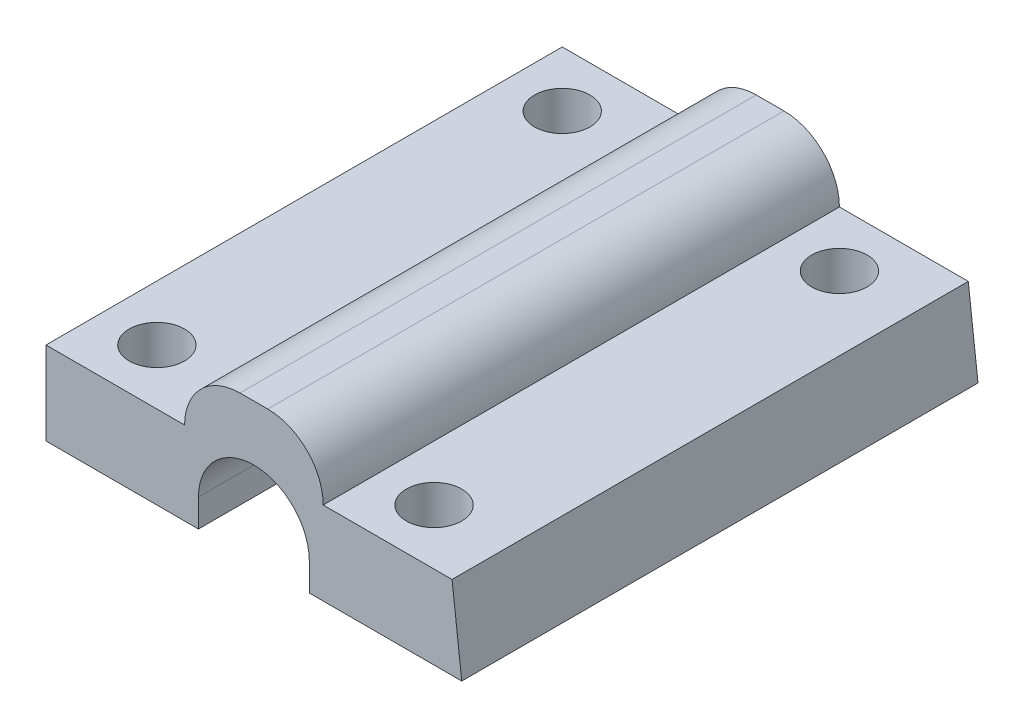
ISO-10303-21;
HEADER;
FILE_DESCRIPTION(('STEP AP214'),'2;1');
FILE_NAME('part.step','',(''),(''),'','','');
FILE_SCHEMA(('AUTOMOTIVE_DESIGN { 1 0 10303 214 1 1 1 1 }'));
ENDSEC;
DATA;
#1=APPLICATION_CONTEXT('core data for automotive mechanical design processes');
#2=APPLICATION_PROTOCOL_DEFINITION('international standard','automotive_design',2000,#1);
#3=PRODUCT_CONTEXT('',#1,'mechanical');
#4=PRODUCT('Part','Part','',(#3));
#5=PRODUCT_RELATED_PRODUCT_CATEGORY('part','',(#4));
#6=PRODUCT_DEFINITION_FORMATION('','',#4);
#7=PRODUCT_DEFINITION_CONTEXT('part definition',#1,'design');
#8=PRODUCT_DEFINITION('design','',#6,#7);
#9=PRODUCT_DEFINITION_SHAPE('','',#8);
#10=(LENGTH_UNIT() NAMED_UNIT(*) SI_UNIT(.MILLI.,.METRE.));
#11=(NAMED_UNIT(*) PLANE_ANGLE_UNIT() SI_UNIT($,.RADIAN.));
#12=(NAMED_UNIT(*) SI_UNIT($,.STERADIAN.) SOLID_ANGLE_UNIT());
#13=UNCERTAINTY_MEASURE_WITH_UNIT(LENGTH_MEASURE(1.E-05),#10,'distance_accuracy_value','');
#14=(GEOMETRIC_REPRESENTATION_CONTEXT(3) GLOBAL_UNCERTAINTY_ASSIGNED_CONTEXT((#13)) GLOBAL_UNIT_ASSIGNED_CONTEXT((#10,
#11,#12)) REPRESENTATION_CONTEXT('',''));
#15=CARTESIAN_POINT('',(0.,0.,0.));
#16=DIRECTION('',(0.,0.,1.));
#17=DIRECTION('',(1.,0.,0.));
#18=AXIS2_PLACEMENT_3D('',#15,#16,#17);
#19=CARTESIAN_POINT('',(0.,0.,0.));
#20=DIRECTION('',(0.,1.,0.));
#21=DIRECTION('',(0.,0.,1.));
#22=AXIS2_PLACEMENT_3D('',#19,#20,#21);
#23=PLANE('',#22);
#24=CARTESIAN_POINT('',(-8.21354166666667,0.,24.8645833333333));
#25=DIRECTION('',(0.,1.,0.));
#26=DIRECTION('',(0.,0.,1.));
#27=AXIS2_PLACEMENT_3D('',#24,#25,#26);
#28=CIRCLE('',#27,2.);
#29=CARTESIAN_POINT('',(-8.21354166666667,0.,26.8645833333333));
#30=VERTEX_POINT('',#29);
#31=EDGE_CURVE('E239',#30,#30,#28,.T.);
#32=ORIENTED_EDGE('',*,*,#31,.T.);
#33=EDGE_LOOP('',(#32));
#34=FACE_BOUND('',#33,.T.);
#35=CARTESIAN_POINT('',(-8.21354166666668,0.,-4.38541666666667));
#36=DIRECTION('',(0.,1.,0.));
#37=DIRECTION('',(0.,0.,1.));
#38=AXIS2_PLACEMENT_3D('',#35,#36,#37);
#39=CIRCLE('',#38,2.);
#40=CARTESIAN_POINT('',(-8.21354166666668,0.,-2.38541666666667));
#41=VERTEX_POINT('',#40);
#42=EDGE_CURVE('E233',#41,#41,#39,.T.);
#43=ORIENTED_EDGE('',*,*,#42,.T.);
#44=EDGE_LOOP('',(#43));
#45=FACE_BOUND('',#44,.T.);
#46=DIRECTION('',(-1.,0.,0.));
#47=VECTOR('',#46,1.);
#48=CARTESIAN_POINT('',(-12.2135416666667,0.,-8.38541666666667));
#49=LINE('',#48,#47);
#50=CARTESIAN_POINT('',(-1.21354166666667,0.,-8.38541666666667));
#51=VERTEX_POINT('',#50);
#52=CARTESIAN_POINT('',(-12.2135416666667,0.,-8.38541666666667));
#53=VERTEX_POINT('',#52);
#54=EDGE_CURVE('E141',#51,#53,#49,.T.);
#55=ORIENTED_EDGE('',*,*,#54,.F.);
#56=DIRECTION('',(0.,0.,-1.));
#57=VECTOR('',#56,1.);
#58=CARTESIAN_POINT('',(-1.21354166666668,0.,28.8645833333333));
#59=LINE('',#58,#57);
#60=CARTESIAN_POINT('',(-1.21354166666668,0.,28.8645833333333));
#61=VERTEX_POINT('',#60);
#62=EDGE_CURVE('E186',#61,#51,#59,.T.);
#63=ORIENTED_EDGE('',*,*,#62,.F.);
#64=DIRECTION('',(1.,0.,0.));
#65=VECTOR('',#64,1.);
#66=CARTESIAN_POINT('',(-12.2135416666667,0.,28.8645833333333));
#67=LINE('',#66,#65);
#68=CARTESIAN_POINT('',(-12.2135416666667,0.,28.8645833333333));
#69=VERTEX_POINT('',#68);
#70=EDGE_CURVE('E142',#69,#61,#67,.T.);
#71=ORIENTED_EDGE('',*,*,#70,.F.);
#72=DIRECTION('',(0.,0.,1.));
#73=VECTOR('',#72,1.);
#74=CARTESIAN_POINT('',(-12.2135416666667,0.,-8.38541666666667));
#75=LINE('',#74,#73);
#76=EDGE_CURVE('E242',#53,#69,#75,.T.);
#77=ORIENTED_EDGE('',*,*,#76,.F.);
#78=EDGE_LOOP('',(#55,#63,#71,#77));
#79=FACE_BOUND('',#78,.T.);
#80=ADVANCED_FACE('F33',(#34,#45,#79),#23,.F.);
#81=CARTESIAN_POINT('',(0.,6.,0.));
#82=DIRECTION('',(0.,1.,0.));
#83=DIRECTION('',(0.,0.,1.));
#84=AXIS2_PLACEMENT_3D('',#81,#82,#83);
#85=PLANE('',#84);
#86=DIRECTION('',(0.,0.,1.));
#87=VECTOR('',#86,1.);
#88=CARTESIAN_POINT('',(-2.21354166666668,6.,-8.38541666666667));
#89=LINE('',#88,#87);
#90=CARTESIAN_POINT('',(-2.21354166666667,6.,-8.38541666666667));
#91=VERTEX_POINT('',#90);
#92=CARTESIAN_POINT('',(-2.21354166666667,6.,28.8645833333333));
#93=VERTEX_POINT('',#92);
#94=EDGE_CURVE('E205',#91,#93,#89,.T.);
#95=ORIENTED_EDGE('',*,*,#94,.F.);
#96=DIRECTION('',(-1.,0.,0.));
#97=VECTOR('',#96,1.);
#98=CARTESIAN_POINT('',(-12.2135416666667,6.,-8.38541666666667));
#99=LINE('',#98,#97);
#100=CARTESIAN_POINT('',(-12.2135416666667,6.,-8.38541666666667));
#101=VERTEX_POINT('',#100);
#102=EDGE_CURVE('E208',#91,#101,#99,.T.);
#103=ORIENTED_EDGE('',*,*,#102,.T.);
#104=DIRECTION('',(0.,0.,1.));
#105=VECTOR('',#104,1.);
#106=CARTESIAN_POINT('',(-12.2135416666667,6.,-8.38541666666667));
#107=LINE('',#106,#105);
#108=CARTESIAN_POINT('',(-12.2135416666667,6.,28.8645833333333));
#109=VERTEX_POINT('',#108);
#110=EDGE_CURVE('E156',#101,#109,#107,.T.);
#111=ORIENTED_EDGE('',*,*,#110,.T.);
#112=DIRECTION('',(1.,0.,0.));
#113=VECTOR('',#112,1.);
#114=CARTESIAN_POINT('',(-12.2135416666667,6.,28.8645833333333));
#115=LINE('',#114,#113);
#116=EDGE_CURVE('E196',#109,#93,#115,.T.);
#117=ORIENTED_EDGE('',*,*,#116,.T.);
#118=EDGE_LOOP('',(#95,#103,#111,#117));
#119=FACE_BOUND('',#118,.T.);
#120=CARTESIAN_POINT('',(-8.21354166666667,6.,24.8645833333333));
#121=DIRECTION('',(0.,1.,0.));
#122=DIRECTION('',(0.,0.,1.));
#123=AXIS2_PLACEMENT_3D('',#120,#121,#122);
#124=CIRCLE('',#123,2.);
#125=CARTESIAN_POINT('',(-8.21354166666667,6.,26.8645833333333));
#126=VERTEX_POINT('',#125);
#127=EDGE_CURVE('E223',#126,#126,#124,.T.);
#128=ORIENTED_EDGE('',*,*,#127,.F.);
#129=EDGE_LOOP('',(#128));
#130=FACE_BOUND('',#129,.T.);
#131=CARTESIAN_POINT('',(-8.21354166666668,6.,-4.38541666666667));
#132=DIRECTION('',(0.,1.,0.));
#133=DIRECTION('',(0.,0.,1.));
#134=AXIS2_PLACEMENT_3D('',#131,#132,#133);
#135=CIRCLE('',#134,2.);
#136=CARTESIAN_POINT('',(-8.21354166666668,6.,-2.38541666666667));
#137=VERTEX_POINT('',#136);
#138=EDGE_CURVE('E236',#137,#137,#135,.T.);
#139=ORIENTED_EDGE('',*,*,#138,.F.);
#140=EDGE_LOOP('',(#139));
#141=FACE_BOUND('',#140,.T.);
#142=ADVANCED_FACE('F203',(#119,#130,#141),#85,.T.);
#143=CARTESIAN_POINT('',(-12.2135416666667,6.,-8.38541666666667));
#144=DIRECTION('',(1.,0.,0.));
#145=DIRECTION('',(0.,0.,-1.));
#146=AXIS2_PLACEMENT_3D('',#143,#144,#145);
#147=PLANE('',#146);
#148=ORIENTED_EDGE('',*,*,#76,.T.);
#149=DIRECTION('',(0.,-1.,0.));
#150=VECTOR('',#149,1.);
#151=CARTESIAN_POINT('',(-12.2135416666667,6.,28.8645833333333));
#152=LINE('',#151,#150);
#153=EDGE_CURVE('E166',#109,#69,#152,.T.);
#154=ORIENTED_EDGE('',*,*,#153,.F.);
#155=ORIENTED_EDGE('',*,*,#110,.F.);
#156=DIRECTION('',(0.,-1.,0.));
#157=VECTOR('',#156,1.);
#158=CARTESIAN_POINT('',(-12.2135416666667,6.,-8.38541666666667));
#159=LINE('',#158,#157);
#160=EDGE_CURVE('E163',#101,#53,#159,.T.);
#161=ORIENTED_EDGE('',*,*,#160,.T.);
#162=EDGE_LOOP('',(#148,#154,#155,#161));
#163=FACE_BOUND('',#162,.T.);
#164=ADVANCED_FACE('F303',(#163),#147,.F.);
#165=CARTESIAN_POINT('',(-12.2135416666667,6.,28.8645833333333));
#166=DIRECTION('',(0.,0.,-1.));
#167=DIRECTION('',(-1.,0.,0.));
#168=AXIS2_PLACEMENT_3D('',#165,#166,#167);
#169=PLANE('',#168);
#170=CARTESIAN_POINT('',(6.78645833333333,0.,28.8645833333333));
#171=VERTEX_POINT('',#170);
#172=CARTESIAN_POINT('',(17.7864583333333,0.,28.8645833333333));
#173=VERTEX_POINT('',#172);
#174=EDGE_CURVE('E247',#171,#173,#67,.T.);
#175=ORIENTED_EDGE('',*,*,#174,.T.);
#176=DIRECTION('',(-0.115969466330902,0.99325277894347,0.));
#177=VECTOR('',#176,1.);
#178=CARTESIAN_POINT('',(16.6918688514665,9.37491633844634,28.8645833333333));
#179=LINE('',#178,#177);
#180=CARTESIAN_POINT('',(17.0859148133589,6.,28.8645833333333));
#181=VERTEX_POINT('',#180);
#182=EDGE_CURVE('E136',#173,#181,#179,.T.);
#183=ORIENTED_EDGE('',*,*,#182,.T.);
#184=CARTESIAN_POINT('',(7.78645833333333,6.,28.8645833333333));
#185=VERTEX_POINT('',#184);
#186=EDGE_CURVE('E159',#185,#181,#115,.T.);
#187=ORIENTED_EDGE('',*,*,#186,.F.);
#188=CARTESIAN_POINT('',(3.78645833333333,6.,28.8645833333333));
#189=DIRECTION('',(0.,0.,-1.));
#190=DIRECTION('',(-1.,0.,0.));
#191=AXIS2_PLACEMENT_3D('',#188,#189,#190);
#192=CIRCLE('',#191,4.);
#193=CARTESIAN_POINT('',(3.78645833333333,10.,28.8645833333333));
#194=VERTEX_POINT('',#193);
#195=EDGE_CURVE('E11',#185,#194,#192,.F.);
#196=ORIENTED_EDGE('',*,*,#195,.T.);
#197=DIRECTION('',(1.,0.,0.));
#198=VECTOR('',#197,1.);
#199=CARTESIAN_POINT('',(-2.21354166666667,10.,28.8645833333333));
#200=LINE('',#199,#198);
#201=CARTESIAN_POINT('',(1.78645833333333,10.,28.8645833333333));
#202=VERTEX_POINT('',#201);
#203=EDGE_CURVE('E198',#202,#194,#200,.T.);
#204=ORIENTED_EDGE('',*,*,#203,.F.);
#205=CARTESIAN_POINT('',(1.78645833333333,6.,28.8645833333333));
#206=DIRECTION('',(0.,0.,-1.));
#207=DIRECTION('',(-1.,0.,0.));
#208=AXIS2_PLACEMENT_3D('',#205,#206,#207);
#209=CIRCLE('',#208,4.);
#210=EDGE_CURVE('E41',#202,#93,#209,.F.);
#211=ORIENTED_EDGE('',*,*,#210,.T.);
#212=ORIENTED_EDGE('',*,*,#116,.F.);
#213=ORIENTED_EDGE('',*,*,#153,.T.);
#214=ORIENTED_EDGE('',*,*,#70,.T.);
#215=DIRECTION('',(0.,-1.,0.));
#216=VECTOR('',#215,1.);
#217=CARTESIAN_POINT('',(-1.21354166666668,6.,28.8645833333333));
#218=LINE('',#217,#216);
#219=CARTESIAN_POINT('',(-1.21354166666668,2.,28.8645833333333));
#220=VERTEX_POINT('',#219);
#221=EDGE_CURVE('E211',#220,#61,#218,.T.);
#222=ORIENTED_EDGE('',*,*,#221,.F.);
#223=CARTESIAN_POINT('',(2.78645833333332,2.,28.8645833333333));
#224=DIRECTION('',(0.,0.,-1.));
#225=DIRECTION('',(-1.,0.,0.));
#226=AXIS2_PLACEMENT_3D('',#223,#224,#225);
#227=CIRCLE('',#226,4.);
#228=CARTESIAN_POINT('',(2.78645833333333,6.,28.8645833333333));
#229=VERTEX_POINT('',#228);
#230=EDGE_CURVE('E180',#220,#229,#227,.T.);
#231=ORIENTED_EDGE('',*,*,#230,.T.);
#232=CARTESIAN_POINT('',(2.78645833333333,2.,28.8645833333333));
#233=DIRECTION('',(0.,0.,-1.));
#234=DIRECTION('',(-1.,0.,0.));
#235=AXIS2_PLACEMENT_3D('',#232,#233,#234);
#236=CIRCLE('',#235,4.);
#237=CARTESIAN_POINT('',(6.78645833333333,2.,28.8645833333333));
#238=VERTEX_POINT('',#237);
#239=EDGE_CURVE('E174',#229,#238,#236,.T.);
#240=ORIENTED_EDGE('',*,*,#239,.T.);
#241=DIRECTION('',(0.,-1.,0.));
#242=VECTOR('',#241,1.);
#243=CARTESIAN_POINT('',(6.78645833333333,6.,28.8645833333333));
#244=LINE('',#243,#242);
#245=EDGE_CURVE('E214',#238,#171,#244,.T.);
#246=ORIENTED_EDGE('',*,*,#245,.T.);
#247=EDGE_LOOP('',(#175,#183,#187,#196,#204,#211,#212,#213,#214,#222,#231,#240,#246));
#248=FACE_BOUND('',#247,.T.);
#249=ADVANCED_FACE('F195',(#248),#169,.F.);
#250=CARTESIAN_POINT('',(-12.2135416666667,6.,-8.38541666666667));
#251=DIRECTION('',(0.,0.,1.));
#252=DIRECTION('',(1.,0.,0.));
#253=AXIS2_PLACEMENT_3D('',#250,#251,#252);
#254=PLANE('',#253);
#255=CARTESIAN_POINT('',(17.0859148133589,6.,-8.38541666666667));
#256=VERTEX_POINT('',#255);
#257=CARTESIAN_POINT('',(7.78645833333333,6.,-8.38541666666667));
#258=VERTEX_POINT('',#257);
#259=EDGE_CURVE('E149',#256,#258,#99,.T.);
#260=ORIENTED_EDGE('',*,*,#259,.F.);
#261=DIRECTION('',(-0.115969466330902,0.99325277894347,0.));
#262=VECTOR('',#261,1.);
#263=CARTESIAN_POINT('',(17.7864583333333,0.,-8.38541666666667));
#264=LINE('',#263,#262);
#265=CARTESIAN_POINT('',(17.7864583333333,0.,-8.38541666666667));
#266=VERTEX_POINT('',#265);
#267=EDGE_CURVE('E133',#266,#256,#264,.T.);
#268=ORIENTED_EDGE('',*,*,#267,.F.);
#269=CARTESIAN_POINT('',(6.78645833333333,0.,-8.38541666666667));
#270=VERTEX_POINT('',#269);
#271=EDGE_CURVE('E148',#266,#270,#49,.T.);
#272=ORIENTED_EDGE('',*,*,#271,.T.);
#273=DIRECTION('',(0.,-1.,0.));
#274=VECTOR('',#273,1.);
#275=CARTESIAN_POINT('',(6.78645833333334,6.,-8.38541666666667));
#276=LINE('',#275,#274);
#277=CARTESIAN_POINT('',(6.78645833333334,2.,-8.38541666666667));
#278=VERTEX_POINT('',#277);
#279=EDGE_CURVE('E256',#278,#270,#276,.T.);
#280=ORIENTED_EDGE('',*,*,#279,.F.);
#281=CARTESIAN_POINT('',(2.78645833333334,2.,-8.38541666666667));
#282=DIRECTION('',(0.,0.,1.));
#283=DIRECTION('',(1.,0.,0.));
#284=AXIS2_PLACEMENT_3D('',#281,#282,#283);
#285=CIRCLE('',#284,4.);
#286=CARTESIAN_POINT('',(2.78645833333334,6.,-8.38541666666667));
#287=VERTEX_POINT('',#286);
#288=EDGE_CURVE('E176',#278,#287,#285,.T.);
#289=ORIENTED_EDGE('',*,*,#288,.T.);
#290=CARTESIAN_POINT('',(2.78645833333333,2.,-8.38541666666667));
#291=DIRECTION('',(0.,0.,1.));
#292=DIRECTION('',(1.,0.,0.));
#293=AXIS2_PLACEMENT_3D('',#290,#291,#292);
#294=CIRCLE('',#293,4.);
#295=CARTESIAN_POINT('',(-1.21354166666667,2.,-8.38541666666667));
#296=VERTEX_POINT('',#295);
#297=EDGE_CURVE('E178',#287,#296,#294,.T.);
#298=ORIENTED_EDGE('',*,*,#297,.T.);
#299=DIRECTION('',(0.,-1.,0.));
#300=VECTOR('',#299,1.);
#301=CARTESIAN_POINT('',(-1.21354166666667,6.,-8.38541666666667));
#302=LINE('',#301,#300);
#303=EDGE_CURVE('E259',#296,#51,#302,.T.);
#304=ORIENTED_EDGE('',*,*,#303,.T.);
#305=ORIENTED_EDGE('',*,*,#54,.T.);
#306=ORIENTED_EDGE('',*,*,#160,.F.);
#307=ORIENTED_EDGE('',*,*,#102,.F.);
#308=CARTESIAN_POINT('',(1.78645833333332,6.,-8.38541666666667));
#309=DIRECTION('',(0.,0.,1.));
#310=DIRECTION('',(1.,0.,0.));
#311=AXIS2_PLACEMENT_3D('',#308,#309,#310);
#312=CIRCLE('',#311,4.);
#313=CARTESIAN_POINT('',(1.78645833333332,10.,-8.38541666666667));
#314=VERTEX_POINT('',#313);
#315=EDGE_CURVE('E48',#91,#314,#312,.F.);
#316=ORIENTED_EDGE('',*,*,#315,.T.);
#317=DIRECTION('',(-1.,0.,0.));
#318=VECTOR('',#317,1.);
#319=CARTESIAN_POINT('',(-2.21354166666668,10.,-8.38541666666667));
#320=LINE('',#319,#318);
#321=CARTESIAN_POINT('',(3.78645833333333,10.,-8.38541666666667));
#322=VERTEX_POINT('',#321);
#323=EDGE_CURVE('E217',#322,#314,#320,.T.);
#324=ORIENTED_EDGE('',*,*,#323,.F.);
#325=CARTESIAN_POINT('',(3.78645833333333,6.,-8.38541666666667));
#326=DIRECTION('',(0.,0.,1.));
#327=DIRECTION('',(1.,0.,0.));
#328=AXIS2_PLACEMENT_3D('',#325,#326,#327);
#329=CIRCLE('',#328,4.);
#330=EDGE_CURVE('E56',#322,#258,#329,.F.);
#331=ORIENTED_EDGE('',*,*,#330,.T.);
#332=EDGE_LOOP('',(#260,#268,#272,#280,#289,#298,#304,#305,#306,#307,#316,#324,#331));
#333=FACE_BOUND('',#332,.T.);
#334=ADVANCED_FACE('F146',(#333),#254,.F.);
#335=DIRECTION('',(0.,0.,-1.));
#336=VECTOR('',#335,1.);
#337=CARTESIAN_POINT('',(17.0859148133589,6.,41.6145833333333));
#338=LINE('',#337,#336);
#339=EDGE_CURVE('E150',#181,#256,#338,.T.);
#340=ORIENTED_EDGE('',*,*,#339,.T.);
#341=ORIENTED_EDGE('',*,*,#259,.T.);
#342=DIRECTION('',(0.,0.,-1.));
#343=VECTOR('',#342,1.);
#344=CARTESIAN_POINT('',(7.78645833333333,6.,-8.38541666666667));
#345=LINE('',#344,#343);
#346=EDGE_CURVE('E210',#185,#258,#345,.T.);
#347=ORIENTED_EDGE('',*,*,#346,.F.);
#348=ORIENTED_EDGE('',*,*,#186,.T.);
#349=EDGE_LOOP('',(#340,#341,#347,#348));
#350=FACE_BOUND('',#349,.T.);
#351=CARTESIAN_POINT('',(11.7864583333333,6.,24.8645833333333));
#352=DIRECTION('',(0.,1.,0.));
#353=DIRECTION('',(0.,0.,1.));
#354=AXIS2_PLACEMENT_3D('',#351,#352,#353);
#355=CIRCLE('',#354,2.);
#356=CARTESIAN_POINT('',(11.7864583333333,6.,26.8645833333333));
#357=VERTEX_POINT('',#356);
#358=EDGE_CURVE('E230',#357,#357,#355,.T.);
#359=ORIENTED_EDGE('',*,*,#358,.F.);
#360=EDGE_LOOP('',(#359));
#361=FACE_BOUND('',#360,.T.);
#362=CARTESIAN_POINT('',(11.7864583333333,6.,-4.38541666666667));
#363=DIRECTION('',(0.,1.,0.));
#364=DIRECTION('',(0.,0.,1.));
#365=AXIS2_PLACEMENT_3D('',#362,#363,#364);
#366=CIRCLE('',#365,2.);
#367=CARTESIAN_POINT('',(11.7864583333333,6.,-2.38541666666667));
#368=VERTEX_POINT('',#367);
#369=EDGE_CURVE('E224',#368,#368,#366,.T.);
#370=ORIENTED_EDGE('',*,*,#369,.F.);
#371=EDGE_LOOP('',(#370));
#372=FACE_BOUND('',#371,.T.);
#373=ADVANCED_FACE('F271',(#350,#361,#372),#85,.T.);
#374=CARTESIAN_POINT('',(11.7864583333333,0.,24.8645833333333));
#375=DIRECTION('',(0.,1.,0.));
#376=DIRECTION('',(0.,0.,1.));
#377=AXIS2_PLACEMENT_3D('',#374,#375,#376);
#378=CIRCLE('',#377,2.);
#379=CARTESIAN_POINT('',(11.7864583333333,0.,26.8645833333333));
#380=VERTEX_POINT('',#379);
#381=EDGE_CURVE('E227',#380,#380,#378,.T.);
#382=ORIENTED_EDGE('',*,*,#381,.T.);
#383=EDGE_LOOP('',(#382));
#384=FACE_BOUND('',#383,.T.);
#385=CARTESIAN_POINT('',(11.7864583333333,0.,-4.38541666666667));
#386=DIRECTION('',(0.,1.,0.));
#387=DIRECTION('',(0.,0.,1.));
#388=AXIS2_PLACEMENT_3D('',#385,#386,#387);
#389=CIRCLE('',#388,2.);
#390=CARTESIAN_POINT('',(11.7864583333333,0.,-2.38541666666667));
#391=VERTEX_POINT('',#390);
#392=EDGE_CURVE('E220',#391,#391,#389,.T.);
#393=ORIENTED_EDGE('',*,*,#392,.T.);
#394=EDGE_LOOP('',(#393));
#395=FACE_BOUND('',#394,.T.);
#396=ORIENTED_EDGE('',*,*,#174,.F.);
#397=DIRECTION('',(0.,0.,1.));
#398=VECTOR('',#397,1.);
#399=CARTESIAN_POINT('',(6.78645833333333,0.,28.8645833333333));
#400=LINE('',#399,#398);
#401=EDGE_CURVE('E155',#270,#171,#400,.T.);
#402=ORIENTED_EDGE('',*,*,#401,.F.);
#403=ORIENTED_EDGE('',*,*,#271,.F.);
#404=DIRECTION('',(0.,0.,-1.));
#405=VECTOR('',#404,1.);
#406=CARTESIAN_POINT('',(17.7864583333333,0.,-8.38541666666667));
#407=LINE('',#406,#405);
#408=EDGE_CURVE('E130',#173,#266,#407,.T.);
#409=ORIENTED_EDGE('',*,*,#408,.F.);
#410=EDGE_LOOP('',(#396,#402,#403,#409));
#411=FACE_BOUND('',#410,.T.);
#412=ADVANCED_FACE('F153',(#384,#395,#411),#23,.F.);
#413=CARTESIAN_POINT('',(-8.21354166666667,0.,24.8645833333333));
#414=DIRECTION('',(0.,1.,0.));
#415=DIRECTION('',(0.,0.,1.));
#416=AXIS2_PLACEMENT_3D('',#413,#414,#415);
#417=CYLINDRICAL_SURFACE('',#416,2.);
#418=ORIENTED_EDGE('',*,*,#31,.F.);
#419=EDGE_LOOP('',(#418));
#420=FACE_BOUND('',#419,.T.);
#421=ORIENTED_EDGE('',*,*,#127,.T.);
#422=EDGE_LOOP('',(#421));
#423=FACE_BOUND('',#422,.T.);
#424=ADVANCED_FACE('F283',(#420,#423),#417,.F.);
#425=CARTESIAN_POINT('',(11.7864583333333,0.,-4.38541666666667));
#426=DIRECTION('',(0.,1.,0.));
#427=DIRECTION('',(0.,0.,1.));
#428=AXIS2_PLACEMENT_3D('',#425,#426,#427);
#429=CYLINDRICAL_SURFACE('',#428,2.);
#430=ORIENTED_EDGE('',*,*,#392,.F.);
#431=EDGE_LOOP('',(#430));
#432=FACE_BOUND('',#431,.T.);
#433=ORIENTED_EDGE('',*,*,#369,.T.);
#434=EDGE_LOOP('',(#433));
#435=FACE_BOUND('',#434,.T.);
#436=ADVANCED_FACE('F280',(#432,#435),#429,.F.);
#437=CARTESIAN_POINT('',(11.7864583333333,0.,24.8645833333333));
#438=DIRECTION('',(0.,1.,0.));
#439=DIRECTION('',(0.,0.,1.));
#440=AXIS2_PLACEMENT_3D('',#437,#438,#439);
#441=CYLINDRICAL_SURFACE('',#440,2.);
#442=ORIENTED_EDGE('',*,*,#381,.F.);
#443=EDGE_LOOP('',(#442));
#444=FACE_BOUND('',#443,.T.);
#445=ORIENTED_EDGE('',*,*,#358,.T.);
#446=EDGE_LOOP('',(#445));
#447=FACE_BOUND('',#446,.T.);
#448=ADVANCED_FACE('F282',(#444,#447),#441,.F.);
#449=CARTESIAN_POINT('',(-8.21354166666668,0.,-4.38541666666667));
#450=DIRECTION('',(0.,1.,0.));
#451=DIRECTION('',(0.,0.,1.));
#452=AXIS2_PLACEMENT_3D('',#449,#450,#451);
#453=CYLINDRICAL_SURFACE('',#452,2.);
#454=ORIENTED_EDGE('',*,*,#42,.F.);
#455=EDGE_LOOP('',(#454));
#456=FACE_BOUND('',#455,.T.);
#457=ORIENTED_EDGE('',*,*,#138,.T.);
#458=EDGE_LOOP('',(#457));
#459=FACE_BOUND('',#458,.T.);
#460=ADVANCED_FACE('F290',(#456,#459),#453,.F.);
#461=CARTESIAN_POINT('',(0.,10.,0.));
#462=DIRECTION('',(0.,1.,0.));
#463=DIRECTION('',(0.,0.,1.));
#464=AXIS2_PLACEMENT_3D('',#461,#462,#463);
#465=PLANE('',#464);
#466=ORIENTED_EDGE('',*,*,#203,.T.);
#467=DIRECTION('',(0.,0.,-1.));
#468=VECTOR('',#467,1.);
#469=CARTESIAN_POINT('',(3.78645833333333,10.,-8.38541666666667));
#470=LINE('',#469,#468);
#471=EDGE_CURVE('E189',#194,#322,#470,.T.);
#472=ORIENTED_EDGE('',*,*,#471,.T.);
#473=ORIENTED_EDGE('',*,*,#323,.T.);
#474=DIRECTION('',(0.,0.,1.));
#475=VECTOR('',#474,1.);
#476=CARTESIAN_POINT('',(1.78645833333333,10.,28.8645833333333));
#477=LINE('',#476,#475);
#478=EDGE_CURVE('E182',#314,#202,#477,.T.);
#479=ORIENTED_EDGE('',*,*,#478,.T.);
#480=EDGE_LOOP('',(#466,#472,#473,#479));
#481=FACE_BOUND('',#480,.T.);
#482=ADVANCED_FACE('F267',(#481),#465,.T.);
#483=CARTESIAN_POINT('',(-1.21354166666668,6.,28.8645833333333));
#484=DIRECTION('',(-1.,0.,0.));
#485=DIRECTION('',(0.,0.,1.));
#486=AXIS2_PLACEMENT_3D('',#483,#484,#485);
#487=PLANE('',#486);
#488=ORIENTED_EDGE('',*,*,#303,.F.);
#489=DIRECTION('',(0.,0.,-1.));
#490=VECTOR('',#489,1.);
#491=CARTESIAN_POINT('',(-1.21354166666668,2.,28.8645833333333));
#492=LINE('',#491,#490);
#493=EDGE_CURVE('E172',#296,#220,#492,.F.);
#494=ORIENTED_EDGE('',*,*,#493,.T.);
#495=ORIENTED_EDGE('',*,*,#221,.T.);
#496=ORIENTED_EDGE('',*,*,#62,.T.);
#497=EDGE_LOOP('',(#488,#494,#495,#496));
#498=FACE_BOUND('',#497,.T.);
#499=ADVANCED_FACE('F359',(#498),#487,.F.);
#500=CARTESIAN_POINT('',(6.78645833333333,6.,28.8645833333333));
#501=DIRECTION('',(1.,0.,0.));
#502=DIRECTION('',(0.,0.,-1.));
#503=AXIS2_PLACEMENT_3D('',#500,#501,#502);
#504=PLANE('',#503);
#505=ORIENTED_EDGE('',*,*,#245,.F.);
#506=DIRECTION('',(0.,0.,1.));
#507=VECTOR('',#506,1.);
#508=CARTESIAN_POINT('',(6.78645833333333,2.,28.8645833333333));
#509=LINE('',#508,#507);
#510=EDGE_CURVE('E169',#238,#278,#509,.F.);
#511=ORIENTED_EDGE('',*,*,#510,.T.);
#512=ORIENTED_EDGE('',*,*,#279,.T.);
#513=ORIENTED_EDGE('',*,*,#401,.T.);
#514=EDGE_LOOP('',(#505,#511,#512,#513));
#515=FACE_BOUND('',#514,.T.);
#516=ADVANCED_FACE('F258',(#515),#504,.F.);
#517=CARTESIAN_POINT('',(2.78645833333333,2.,0.));
#518=DIRECTION('',(0.,0.,-1.));
#519=DIRECTION('',(-1.,0.,0.));
#520=AXIS2_PLACEMENT_3D('',#517,#518,#519);
#521=CYLINDRICAL_SURFACE('',#520,4.);
#522=ORIENTED_EDGE('',*,*,#493,.F.);
#523=ORIENTED_EDGE('',*,*,#297,.F.);
#524=DIRECTION('',(0.,0.,-1.));
#525=VECTOR('',#524,1.);
#526=CARTESIAN_POINT('',(2.78645833333333,6.,0.));
#527=LINE('',#526,#525);
#528=EDGE_CURVE('E183',#229,#287,#527,.T.);
#529=ORIENTED_EDGE('',*,*,#528,.F.);
#530=ORIENTED_EDGE('',*,*,#230,.F.);
#531=EDGE_LOOP('',(#522,#523,#529,#530));
#532=FACE_BOUND('',#531,.T.);
#533=ADVANCED_FACE('F343',(#532),#521,.F.);
#534=CARTESIAN_POINT('',(2.78645833333333,2.,0.));
#535=DIRECTION('',(0.,0.,1.));
#536=DIRECTION('',(1.,0.,0.));
#537=AXIS2_PLACEMENT_3D('',#534,#535,#536);
#538=CYLINDRICAL_SURFACE('',#537,4.);
#539=ORIENTED_EDGE('',*,*,#288,.F.);
#540=ORIENTED_EDGE('',*,*,#510,.F.);
#541=ORIENTED_EDGE('',*,*,#239,.F.);
#542=ORIENTED_EDGE('',*,*,#528,.T.);
#543=EDGE_LOOP('',(#539,#540,#541,#542));
#544=FACE_BOUND('',#543,.T.);
#545=ADVANCED_FACE('F336',(#544),#538,.F.);
#546=CARTESIAN_POINT('',(3.78645833333333,6.,0.));
#547=DIRECTION('',(0.,0.,1.));
#548=DIRECTION('',(1.,0.,0.));
#549=AXIS2_PLACEMENT_3D('',#546,#547,#548);
#550=CYLINDRICAL_SURFACE('',#549,4.);
#551=ORIENTED_EDGE('',*,*,#195,.F.);
#552=ORIENTED_EDGE('',*,*,#346,.T.);
#553=ORIENTED_EDGE('',*,*,#330,.F.);
#554=ORIENTED_EDGE('',*,*,#471,.F.);
#555=EDGE_LOOP('',(#551,#552,#553,#554));
#556=FACE_BOUND('',#555,.T.);
#557=ADVANCED_FACE('F269',(#556),#550,.T.);
#558=CARTESIAN_POINT('',(1.78645833333333,6.,0.));
#559=DIRECTION('',(0.,0.,-1.));
#560=DIRECTION('',(-1.,0.,0.));
#561=AXIS2_PLACEMENT_3D('',#558,#559,#560);
#562=CYLINDRICAL_SURFACE('',#561,4.);
#563=ORIENTED_EDGE('',*,*,#315,.F.);
#564=ORIENTED_EDGE('',*,*,#94,.T.);
#565=ORIENTED_EDGE('',*,*,#210,.F.);
#566=ORIENTED_EDGE('',*,*,#478,.F.);
#567=EDGE_LOOP('',(#563,#564,#565,#566));
#568=FACE_BOUND('',#567,.T.);
#569=ADVANCED_FACE('F35',(#568),#562,.T.);
#570=CARTESIAN_POINT('',(17.7864583333333,0.,41.6145833333333));
#571=DIRECTION('',(-0.99325277894347,-0.115969466330902,0.));
#572=DIRECTION('',(0.115969466330902,-0.99325277894347,0.));
#573=AXIS2_PLACEMENT_3D('',#570,#571,#572);
#574=PLANE('',#573);
#575=ORIENTED_EDGE('',*,*,#408,.T.);
#576=ORIENTED_EDGE('',*,*,#267,.T.);
#577=ORIENTED_EDGE('',*,*,#339,.F.);
#578=ORIENTED_EDGE('',*,*,#182,.F.);
#579=EDGE_LOOP('',(#575,#576,#577,#578));
#580=FACE_BOUND('',#579,.T.);
#581=ADVANCED_FACE('F132',(#580),#574,.F.);
#582=CLOSED_SHELL('',(#80,#142,#164,#249,#334,#373,#412,#424,#436,#448,#460,#482,#499,#516,#533,
#545,#557,#569,#581));
#583=MANIFOLD_SOLID_BREP('B2',#582);
#584=ADVANCED_BREP_SHAPE_REPRESENTATION('',(#18,#583),#14);
#585=SHAPE_DEFINITION_REPRESENTATION(#9,#584);
ENDSEC;
END-ISO-10303-21;
